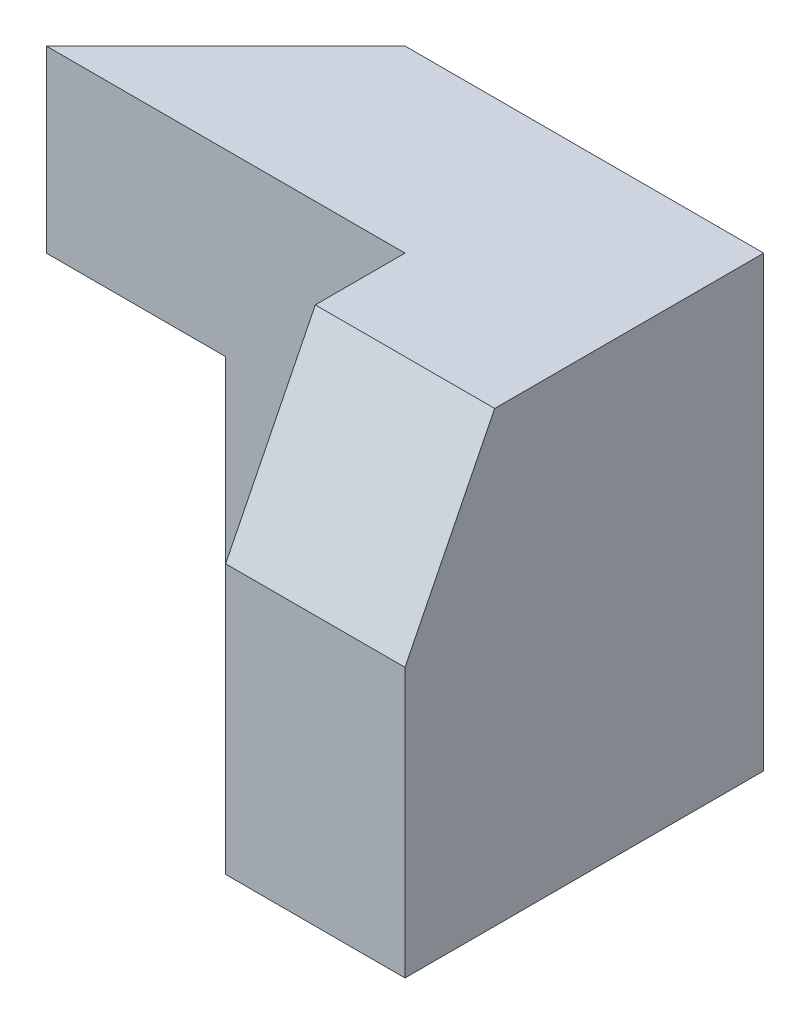
ISO-10303-21;
HEADER;
FILE_DESCRIPTION(('STEP AP214'),'2;1');
FILE_NAME('part.step','',(''),(''),'','','');
FILE_SCHEMA(('AUTOMOTIVE_DESIGN { 1 0 10303 214 1 1 1 1 }'));
ENDSEC;
DATA;
#1=APPLICATION_CONTEXT('core data for automotive mechanical design processes');
#2=APPLICATION_PROTOCOL_DEFINITION('international standard','automotive_design',2000,#1);
#3=PRODUCT_CONTEXT('',#1,'mechanical');
#4=PRODUCT('Part','Part','',(#3));
#5=PRODUCT_RELATED_PRODUCT_CATEGORY('part','',(#4));
#6=PRODUCT_DEFINITION_FORMATION('','',#4);
#7=PRODUCT_DEFINITION_CONTEXT('part definition',#1,'design');
#8=PRODUCT_DEFINITION('design','',#6,#7);
#9=PRODUCT_DEFINITION_SHAPE('','',#8);
#10=(LENGTH_UNIT() NAMED_UNIT(*) SI_UNIT(.MILLI.,.METRE.));
#11=(NAMED_UNIT(*) PLANE_ANGLE_UNIT() SI_UNIT($,.RADIAN.));
#12=(NAMED_UNIT(*) SI_UNIT($,.STERADIAN.) SOLID_ANGLE_UNIT());
#13=UNCERTAINTY_MEASURE_WITH_UNIT(LENGTH_MEASURE(1.E-05),#10,'distance_accuracy_value','');
#14=(GEOMETRIC_REPRESENTATION_CONTEXT(3) GLOBAL_UNCERTAINTY_ASSIGNED_CONTEXT((#13)) GLOBAL_UNIT_ASSIGNED_CONTEXT((#10,
#11,#12)) REPRESENTATION_CONTEXT('',''));
#15=CARTESIAN_POINT('',(0.,0.,0.));
#16=DIRECTION('',(0.,0.,1.));
#17=DIRECTION('',(1.,0.,0.));
#18=AXIS2_PLACEMENT_3D('',#15,#16,#17);
#19=CARTESIAN_POINT('',(20.,0.,10.));
#20=DIRECTION('',(1.,0.,0.));
#21=DIRECTION('',(0.,0.,-1.));
#22=AXIS2_PLACEMENT_3D('',#19,#20,#21);
#23=PLANE('',#22);
#24=DIRECTION('',(0.,0.,1.));
#25=VECTOR('',#24,1.);
#26=CARTESIAN_POINT('',(20.,25.,10.));
#27=LINE('',#26,#25);
#28=CARTESIAN_POINT('',(20.,25.,10.));
#29=VERTEX_POINT('',#28);
#30=CARTESIAN_POINT('',(20.,25.,15.));
#31=VERTEX_POINT('',#30);
#32=EDGE_CURVE('E161',#29,#31,#27,.T.);
#33=ORIENTED_EDGE('',*,*,#32,.F.);
#34=DIRECTION('',(0.,1.,0.));
#35=VECTOR('',#34,1.);
#36=CARTESIAN_POINT('',(20.,0.,10.));
#37=LINE('',#36,#35);
#38=CARTESIAN_POINT('',(20.,0.,10.));
#39=VERTEX_POINT('',#38);
#40=EDGE_CURVE('E48',#39,#29,#37,.T.);
#41=ORIENTED_EDGE('',*,*,#40,.F.);
#42=DIRECTION('',(0.,0.,1.));
#43=VECTOR('',#42,1.);
#44=CARTESIAN_POINT('',(20.,0.,10.));
#45=LINE('',#44,#43);
#46=CARTESIAN_POINT('',(20.,0.,20.));
#47=VERTEX_POINT('',#46);
#48=EDGE_CURVE('E158',#39,#47,#45,.T.);
#49=ORIENTED_EDGE('',*,*,#48,.T.);
#50=DIRECTION('',(0.,1.,0.));
#51=VECTOR('',#50,1.);
#52=CARTESIAN_POINT('',(20.,0.,20.));
#53=LINE('',#52,#51);
#54=CARTESIAN_POINT('',(20.,15.,20.));
#55=VERTEX_POINT('',#54);
#56=EDGE_CURVE('E154',#47,#55,#53,.T.);
#57=ORIENTED_EDGE('',*,*,#56,.T.);
#58=DIRECTION('',(0.,-0.894427190999916,0.447213595499958));
#59=VECTOR('',#58,1.);
#60=CARTESIAN_POINT('',(20.,25.,15.));
#61=LINE('',#60,#59);
#62=EDGE_CURVE('E143',#31,#55,#61,.T.);
#63=ORIENTED_EDGE('',*,*,#62,.F.);
#64=EDGE_LOOP('',(#33,#41,#49,#57,#63));
#65=FACE_BOUND('',#64,.T.);
#66=ADVANCED_FACE('F33',(#65),#23,.F.);
#67=CARTESIAN_POINT('',(0.,15.,10.));
#68=DIRECTION('',(0.,1.,0.));
#69=DIRECTION('',(0.,0.,1.));
#70=AXIS2_PLACEMENT_3D('',#67,#68,#69);
#71=PLANE('',#70);
#72=DIRECTION('',(0.707106781186548,0.,0.707106781186548));
#73=VECTOR('',#72,1.);
#74=CARTESIAN_POINT('',(10.,15.,10.));
#75=LINE('',#74,#73);
#76=CARTESIAN_POINT('',(0.,15.,0.));
#77=VERTEX_POINT('',#76);
#78=CARTESIAN_POINT('',(5.,15.,5.));
#79=VERTEX_POINT('',#78);
#80=EDGE_CURVE('E11',#77,#79,#75,.T.);
#81=ORIENTED_EDGE('',*,*,#80,.T.);
#82=DIRECTION('',(-0.707106781186548,0.,0.707106781186548));
#83=VECTOR('',#82,1.);
#84=CARTESIAN_POINT('',(10.,15.,0.));
#85=LINE('',#84,#83);
#86=CARTESIAN_POINT('',(10.,15.,0.));
#87=VERTEX_POINT('',#86);
#88=EDGE_CURVE('E55',#87,#79,#85,.T.);
#89=ORIENTED_EDGE('',*,*,#88,.F.);
#90=DIRECTION('',(1.,0.,0.));
#91=VECTOR('',#90,1.);
#92=CARTESIAN_POINT('',(0.,15.,0.));
#93=LINE('',#92,#91);
#94=EDGE_CURVE('E134',#77,#87,#93,.T.);
#95=ORIENTED_EDGE('',*,*,#94,.F.);
#96=EDGE_LOOP('',(#81,#89,#95));
#97=FACE_BOUND('',#96,.T.);
#98=ADVANCED_FACE('F207',(#97),#71,.T.);
#99=CARTESIAN_POINT('',(0.,25.,20.));
#100=DIRECTION('',(0.,-1.,0.));
#101=DIRECTION('',(0.,0.,-1.));
#102=AXIS2_PLACEMENT_3D('',#99,#100,#101);
#103=PLANE('',#102);
#104=DIRECTION('',(-1.,0.,0.));
#105=VECTOR('',#104,1.);
#106=CARTESIAN_POINT('',(0.,25.,0.));
#107=LINE('',#106,#105);
#108=CARTESIAN_POINT('',(30.,25.,0.));
#109=VERTEX_POINT('',#108);
#110=CARTESIAN_POINT('',(10.,25.,0.));
#111=VERTEX_POINT('',#110);
#112=EDGE_CURVE('E107',#109,#111,#107,.T.);
#113=ORIENTED_EDGE('',*,*,#112,.T.);
#114=DIRECTION('',(-0.707106781186548,0.,0.707106781186548));
#115=VECTOR('',#114,1.);
#116=CARTESIAN_POINT('',(10.,25.,0.));
#117=LINE('',#116,#115);
#118=CARTESIAN_POINT('',(0.,25.,10.));
#119=VERTEX_POINT('',#118);
#120=EDGE_CURVE('E111',#111,#119,#117,.T.);
#121=ORIENTED_EDGE('',*,*,#120,.T.);
#122=DIRECTION('',(1.,0.,0.));
#123=VECTOR('',#122,1.);
#124=CARTESIAN_POINT('',(0.,25.,10.));
#125=LINE('',#124,#123);
#126=EDGE_CURVE('E129',#119,#29,#125,.T.);
#127=ORIENTED_EDGE('',*,*,#126,.T.);
#128=ORIENTED_EDGE('',*,*,#32,.T.);
#129=DIRECTION('',(-1.,0.,0.));
#130=VECTOR('',#129,1.);
#131=CARTESIAN_POINT('',(40.,25.,15.));
#132=LINE('',#131,#130);
#133=CARTESIAN_POINT('',(30.,25.,15.));
#134=VERTEX_POINT('',#133);
#135=EDGE_CURVE('E145',#134,#31,#132,.T.);
#136=ORIENTED_EDGE('',*,*,#135,.F.);
#137=DIRECTION('',(0.,0.,-1.));
#138=VECTOR('',#137,1.);
#139=CARTESIAN_POINT('',(30.,25.,20.));
#140=LINE('',#139,#138);
#141=EDGE_CURVE('E115',#134,#109,#140,.T.);
#142=ORIENTED_EDGE('',*,*,#141,.T.);
#143=EDGE_LOOP('',(#113,#121,#127,#128,#136,#142));
#144=FACE_BOUND('',#143,.T.);
#145=ADVANCED_FACE('F109',(#144),#103,.F.);
#146=CARTESIAN_POINT('',(0.,0.,0.));
#147=DIRECTION('',(0.,0.,-1.));
#148=DIRECTION('',(-1.,0.,0.));
#149=AXIS2_PLACEMENT_3D('',#146,#147,#148);
#150=PLANE('',#149);
#151=DIRECTION('',(0.,-1.,0.));
#152=VECTOR('',#151,1.);
#153=CARTESIAN_POINT('',(10.,25.,0.));
#154=LINE('',#153,#152);
#155=EDGE_CURVE('E126',#111,#87,#154,.T.);
#156=ORIENTED_EDGE('',*,*,#155,.F.);
#157=ORIENTED_EDGE('',*,*,#112,.F.);
#158=DIRECTION('',(0.,1.,0.));
#159=VECTOR('',#158,1.);
#160=CARTESIAN_POINT('',(30.,0.,0.));
#161=LINE('',#160,#159);
#162=CARTESIAN_POINT('',(30.,0.,0.));
#163=VERTEX_POINT('',#162);
#164=EDGE_CURVE('E121',#163,#109,#161,.T.);
#165=ORIENTED_EDGE('',*,*,#164,.F.);
#166=DIRECTION('',(1.,0.,0.));
#167=VECTOR('',#166,1.);
#168=CARTESIAN_POINT('',(0.,0.,0.));
#169=LINE('',#168,#167);
#170=CARTESIAN_POINT('',(0.,0.,0.));
#171=VERTEX_POINT('',#170);
#172=EDGE_CURVE('E170',#171,#163,#169,.T.);
#173=ORIENTED_EDGE('',*,*,#172,.F.);
#174=DIRECTION('',(0.,-1.,0.));
#175=VECTOR('',#174,1.);
#176=CARTESIAN_POINT('',(0.,0.,0.));
#177=LINE('',#176,#175);
#178=EDGE_CURVE('E163',#77,#171,#177,.T.);
#179=ORIENTED_EDGE('',*,*,#178,.F.);
#180=ORIENTED_EDGE('',*,*,#94,.T.);
#181=EDGE_LOOP('',(#156,#157,#165,#173,#179,#180));
#182=FACE_BOUND('',#181,.T.);
#183=ADVANCED_FACE('F132',(#182),#150,.T.);
#184=CARTESIAN_POINT('',(0.,0.,10.));
#185=DIRECTION('',(0.,0.,-1.));
#186=DIRECTION('',(-1.,0.,0.));
#187=AXIS2_PLACEMENT_3D('',#184,#185,#186);
#188=PLANE('',#187);
#189=ORIENTED_EDGE('',*,*,#40,.T.);
#190=ORIENTED_EDGE('',*,*,#126,.F.);
#191=DIRECTION('',(0.,-1.,0.));
#192=VECTOR('',#191,1.);
#193=CARTESIAN_POINT('',(0.,25.,10.));
#194=LINE('',#193,#192);
#195=CARTESIAN_POINT('',(0.,15.,10.));
#196=VERTEX_POINT('',#195);
#197=EDGE_CURVE('E128',#119,#196,#194,.T.);
#198=ORIENTED_EDGE('',*,*,#197,.T.);
#199=DIRECTION('',(1.,0.,0.));
#200=VECTOR('',#199,1.);
#201=CARTESIAN_POINT('',(0.,15.,10.));
#202=LINE('',#201,#200);
#203=CARTESIAN_POINT('',(10.,15.,10.));
#204=VERTEX_POINT('',#203);
#205=EDGE_CURVE('E130',#196,#204,#202,.T.);
#206=ORIENTED_EDGE('',*,*,#205,.T.);
#207=DIRECTION('',(0.,-1.,0.));
#208=VECTOR('',#207,1.);
#209=CARTESIAN_POINT('',(10.,0.,10.));
#210=LINE('',#209,#208);
#211=CARTESIAN_POINT('',(10.,0.,10.));
#212=VERTEX_POINT('',#211);
#213=EDGE_CURVE('E176',#204,#212,#210,.T.);
#214=ORIENTED_EDGE('',*,*,#213,.T.);
#215=DIRECTION('',(1.,0.,0.));
#216=VECTOR('',#215,1.);
#217=CARTESIAN_POINT('',(0.,0.,10.));
#218=LINE('',#217,#216);
#219=EDGE_CURVE('E155',#212,#39,#218,.T.);
#220=ORIENTED_EDGE('',*,*,#219,.T.);
#221=EDGE_LOOP('',(#189,#190,#198,#206,#214,#220));
#222=FACE_BOUND('',#221,.T.);
#223=ADVANCED_FACE('F187',(#222),#188,.F.);
#224=CARTESIAN_POINT('',(10.,-15.,10.));
#225=DIRECTION('',(0.707106781186548,0.,-0.707106781186548));
#226=DIRECTION('',(-0.707106781186548,0.,-0.707106781186548));
#227=AXIS2_PLACEMENT_3D('',#224,#225,#226);
#228=PLANE('',#227);
#229=ORIENTED_EDGE('',*,*,#80,.F.);
#230=ORIENTED_EDGE('',*,*,#178,.T.);
#231=DIRECTION('',(-0.707106781186548,0.,-0.707106781186548));
#232=VECTOR('',#231,1.);
#233=CARTESIAN_POINT('',(10.,0.,10.));
#234=LINE('',#233,#232);
#235=EDGE_CURVE('E136',#212,#171,#234,.T.);
#236=ORIENTED_EDGE('',*,*,#235,.F.);
#237=ORIENTED_EDGE('',*,*,#213,.F.);
#238=EDGE_CURVE('E41',#79,#204,#75,.T.);
#239=ORIENTED_EDGE('',*,*,#238,.F.);
#240=EDGE_LOOP('',(#229,#230,#236,#237,#239));
#241=FACE_BOUND('',#240,.T.);
#242=ADVANCED_FACE('F206',(#241),#228,.F.);
#243=CARTESIAN_POINT('',(0.,0.,20.));
#244=DIRECTION('',(0.,1.,0.));
#245=DIRECTION('',(0.,0.,1.));
#246=AXIS2_PLACEMENT_3D('',#243,#244,#245);
#247=PLANE('',#246);
#248=ORIENTED_EDGE('',*,*,#219,.F.);
#249=ORIENTED_EDGE('',*,*,#235,.T.);
#250=ORIENTED_EDGE('',*,*,#172,.T.);
#251=DIRECTION('',(0.,0.,-1.));
#252=VECTOR('',#251,1.);
#253=CARTESIAN_POINT('',(30.,0.,20.));
#254=LINE('',#253,#252);
#255=CARTESIAN_POINT('',(30.,0.,20.));
#256=VERTEX_POINT('',#255);
#257=EDGE_CURVE('E174',#256,#163,#254,.T.);
#258=ORIENTED_EDGE('',*,*,#257,.F.);
#259=DIRECTION('',(1.,0.,0.));
#260=VECTOR('',#259,1.);
#261=CARTESIAN_POINT('',(0.,0.,20.));
#262=LINE('',#261,#260);
#263=EDGE_CURVE('E120',#47,#256,#262,.T.);
#264=ORIENTED_EDGE('',*,*,#263,.F.);
#265=ORIENTED_EDGE('',*,*,#48,.F.);
#266=EDGE_LOOP('',(#248,#249,#250,#258,#264,#265));
#267=FACE_BOUND('',#266,.T.);
#268=ADVANCED_FACE('F35',(#267),#247,.F.);
#269=CARTESIAN_POINT('',(30.,0.,20.));
#270=DIRECTION('',(-1.,0.,0.));
#271=DIRECTION('',(0.,0.,1.));
#272=AXIS2_PLACEMENT_3D('',#269,#270,#271);
#273=PLANE('',#272);
#274=ORIENTED_EDGE('',*,*,#141,.F.);
#275=DIRECTION('',(0.,-0.894427190999916,0.447213595499958));
#276=VECTOR('',#275,1.);
#277=CARTESIAN_POINT('',(30.,3.,26.));
#278=LINE('',#277,#276);
#279=CARTESIAN_POINT('',(30.,15.,20.));
#280=VERTEX_POINT('',#279);
#281=EDGE_CURVE('E149',#134,#280,#278,.T.);
#282=ORIENTED_EDGE('',*,*,#281,.T.);
#283=DIRECTION('',(0.,1.,0.));
#284=VECTOR('',#283,1.);
#285=CARTESIAN_POINT('',(30.,0.,20.));
#286=LINE('',#285,#284);
#287=EDGE_CURVE('E166',#256,#280,#286,.T.);
#288=ORIENTED_EDGE('',*,*,#287,.F.);
#289=ORIENTED_EDGE('',*,*,#257,.T.);
#290=ORIENTED_EDGE('',*,*,#164,.T.);
#291=EDGE_LOOP('',(#274,#282,#288,#289,#290));
#292=FACE_BOUND('',#291,.T.);
#293=ADVANCED_FACE('F205',(#292),#273,.F.);
#294=CARTESIAN_POINT('',(0.,0.,20.));
#295=DIRECTION('',(0.,0.,-1.));
#296=DIRECTION('',(-1.,0.,0.));
#297=AXIS2_PLACEMENT_3D('',#294,#295,#296);
#298=PLANE('',#297);
#299=ORIENTED_EDGE('',*,*,#287,.T.);
#300=DIRECTION('',(-1.,0.,0.));
#301=VECTOR('',#300,1.);
#302=CARTESIAN_POINT('',(40.,15.,20.));
#303=LINE('',#302,#301);
#304=EDGE_CURVE('E146',#280,#55,#303,.T.);
#305=ORIENTED_EDGE('',*,*,#304,.T.);
#306=ORIENTED_EDGE('',*,*,#56,.F.);
#307=ORIENTED_EDGE('',*,*,#263,.T.);
#308=EDGE_LOOP('',(#299,#305,#306,#307));
#309=FACE_BOUND('',#308,.T.);
#310=ADVANCED_FACE('F198',(#309),#298,.F.);
#311=CARTESIAN_POINT('',(40.,25.,15.));
#312=DIRECTION('',(0.,-0.447213595499958,-0.894427190999916));
#313=DIRECTION('',(0.,0.894427190999916,-0.447213595499958));
#314=AXIS2_PLACEMENT_3D('',#311,#312,#313);
#315=PLANE('',#314);
#316=ORIENTED_EDGE('',*,*,#135,.T.);
#317=ORIENTED_EDGE('',*,*,#62,.T.);
#318=ORIENTED_EDGE('',*,*,#304,.F.);
#319=ORIENTED_EDGE('',*,*,#281,.F.);
#320=EDGE_LOOP('',(#316,#317,#318,#319));
#321=FACE_BOUND('',#320,.T.);
#322=ADVANCED_FACE('F193',(#321),#315,.F.);
#323=CARTESIAN_POINT('',(0.,15.,0.));
#324=DIRECTION('',(0.,-1.,0.));
#325=DIRECTION('',(0.,0.,-1.));
#326=AXIS2_PLACEMENT_3D('',#323,#324,#325);
#327=PLANE('',#326);
#328=ORIENTED_EDGE('',*,*,#238,.T.);
#329=ORIENTED_EDGE('',*,*,#205,.F.);
#330=EDGE_CURVE('E184',#79,#196,#85,.T.);
#331=ORIENTED_EDGE('',*,*,#330,.F.);
#332=EDGE_LOOP('',(#328,#329,#331));
#333=FACE_BOUND('',#332,.T.);
#334=ADVANCED_FACE('F183',(#333),#327,.T.);
#335=CARTESIAN_POINT('',(10.,25.,0.));
#336=DIRECTION('',(0.707106781186547,0.,0.707106781186547));
#337=DIRECTION('',(0.707106781186548,0.,-0.707106781186548));
#338=AXIS2_PLACEMENT_3D('',#335,#336,#337);
#339=PLANE('',#338);
#340=ORIENTED_EDGE('',*,*,#88,.T.);
#341=ORIENTED_EDGE('',*,*,#330,.T.);
#342=ORIENTED_EDGE('',*,*,#197,.F.);
#343=ORIENTED_EDGE('',*,*,#120,.F.);
#344=ORIENTED_EDGE('',*,*,#155,.T.);
#345=EDGE_LOOP('',(#340,#341,#342,#343,#344));
#346=FACE_BOUND('',#345,.T.);
#347=ADVANCED_FACE('F125',(#346),#339,.F.);
#348=CLOSED_SHELL('',(#66,#98,#145,#183,#223,#242,#268,#293,#310,#322,#334,#347));
#349=MANIFOLD_SOLID_BREP('B2',#348);
#350=ADVANCED_BREP_SHAPE_REPRESENTATION('',(#18,#349),#14);
#351=SHAPE_DEFINITION_REPRESENTATION(#9,#350);
ENDSEC;
END-ISO-10303-21;
